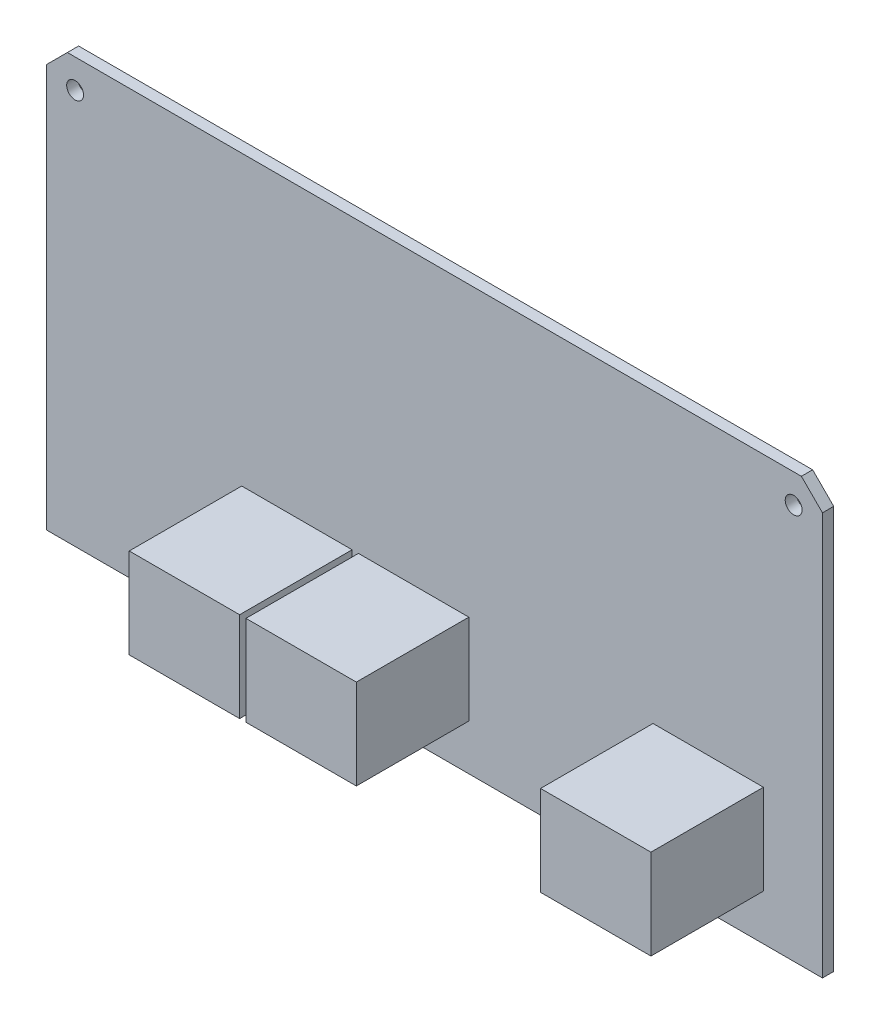
ISO-10303-21;
HEADER;
FILE_DESCRIPTION(('STEP AP214'),'2;1');
FILE_NAME('part.step','',(''),(''),'','','');
FILE_SCHEMA(('AUTOMOTIVE_DESIGN { 1 0 10303 214 1 1 1 1 }'));
ENDSEC;
DATA;
#1=APPLICATION_CONTEXT('core data for automotive mechanical design processes');
#2=APPLICATION_PROTOCOL_DEFINITION('international standard','automotive_design',2000,#1);
#3=PRODUCT_CONTEXT('',#1,'mechanical');
#4=PRODUCT('Part','Part','',(#3));
#5=PRODUCT_RELATED_PRODUCT_CATEGORY('part','',(#4));
#6=PRODUCT_DEFINITION_FORMATION('','',#4);
#7=PRODUCT_DEFINITION_CONTEXT('part definition',#1,'design');
#8=PRODUCT_DEFINITION('design','',#6,#7);
#9=PRODUCT_DEFINITION_SHAPE('','',#8);
#10=(LENGTH_UNIT() NAMED_UNIT(*) SI_UNIT(.MILLI.,.METRE.));
#11=(NAMED_UNIT(*) PLANE_ANGLE_UNIT() SI_UNIT($,.RADIAN.));
#12=(NAMED_UNIT(*) SI_UNIT($,.STERADIAN.) SOLID_ANGLE_UNIT());
#13=UNCERTAINTY_MEASURE_WITH_UNIT(LENGTH_MEASURE(1.E-05),#10,'distance_accuracy_value','');
#14=(GEOMETRIC_REPRESENTATION_CONTEXT(3) GLOBAL_UNCERTAINTY_ASSIGNED_CONTEXT((#13)) GLOBAL_UNIT_ASSIGNED_CONTEXT((#10,
#11,#12)) REPRESENTATION_CONTEXT('',''));
#15=CARTESIAN_POINT('',(0.,0.,0.));
#16=DIRECTION('',(0.,0.,1.));
#17=DIRECTION('',(1.,0.,0.));
#18=AXIS2_PLACEMENT_3D('',#15,#16,#17);
#19=CARTESIAN_POINT('',(55.2,30.15,1.6));
#20=DIRECTION('',(0.,0.,1.));
#21=DIRECTION('',(1.,0.,0.));
#22=AXIS2_PLACEMENT_3D('',#19,#20,#21);
#23=PLANE('',#22);
#24=DIRECTION('',(1.,0.,0.));
#25=VECTOR('',#24,1.);
#26=CARTESIAN_POINT('',(-10.8,-23.65,1.6));
#27=LINE('',#26,#25);
#28=CARTESIAN_POINT('',(-10.8,-23.65,1.6));
#29=VERTEX_POINT('',#28);
#30=CARTESIAN_POINT('',(4.90000000000003,-23.65,1.6));
#31=VERTEX_POINT('',#30);
#32=EDGE_CURVE('E185',#29,#31,#27,.T.);
#33=ORIENTED_EDGE('',*,*,#32,.F.);
#34=DIRECTION('',(0.,-1.,0.));
#35=VECTOR('',#34,1.);
#36=CARTESIAN_POINT('',(-10.8,-23.65,1.6));
#37=LINE('',#36,#35);
#38=CARTESIAN_POINT('',(-10.8,-10.85,1.6));
#39=VERTEX_POINT('',#38);
#40=EDGE_CURVE('E182',#39,#29,#37,.T.);
#41=ORIENTED_EDGE('',*,*,#40,.F.);
#42=DIRECTION('',(-1.,0.,0.));
#43=VECTOR('',#42,1.);
#44=CARTESIAN_POINT('',(-10.8,-10.85,1.6));
#45=LINE('',#44,#43);
#46=CARTESIAN_POINT('',(4.90000000000002,-10.85,1.6));
#47=VERTEX_POINT('',#46);
#48=EDGE_CURVE('E194',#47,#39,#45,.T.);
#49=ORIENTED_EDGE('',*,*,#48,.F.);
#50=DIRECTION('',(0.,1.,0.));
#51=VECTOR('',#50,1.);
#52=CARTESIAN_POINT('',(4.90000000000003,-23.65,1.6));
#53=LINE('',#52,#51);
#54=EDGE_CURVE('E202',#31,#47,#53,.T.);
#55=ORIENTED_EDGE('',*,*,#54,.F.);
#56=EDGE_LOOP('',(#33,#41,#49,#55));
#57=FACE_BOUND('',#56,.T.);
#58=CARTESIAN_POINT('',(51.1,26.05,1.6));
#59=DIRECTION('',(0.,0.,1.));
#60=DIRECTION('',(1.,0.,0.));
#61=AXIS2_PLACEMENT_3D('',#58,#59,#60);
#62=CIRCLE('',#61,1.2);
#63=CARTESIAN_POINT('',(52.3,26.05,1.6));
#64=VERTEX_POINT('',#63);
#65=EDGE_CURVE('E243',#64,#64,#62,.T.);
#66=ORIENTED_EDGE('',*,*,#65,.F.);
#67=EDGE_LOOP('',(#66));
#68=FACE_BOUND('',#67,.T.);
#69=DIRECTION('',(0.,1.,0.));
#70=VECTOR('',#69,1.);
#71=CARTESIAN_POINT('',(55.2,-30.15,1.6));
#72=LINE('',#71,#70);
#73=CARTESIAN_POINT('',(55.2,-30.15,1.6));
#74=VERTEX_POINT('',#73);
#75=CARTESIAN_POINT('',(55.2,27.15,1.6));
#76=VERTEX_POINT('',#75);
#77=EDGE_CURVE('E255',#74,#76,#72,.T.);
#78=ORIENTED_EDGE('',*,*,#77,.T.);
#79=DIRECTION('',(-0.707106781186548,0.707106781186547,0.));
#80=VECTOR('',#79,1.);
#81=CARTESIAN_POINT('',(55.2,27.15,1.6));
#82=LINE('',#81,#80);
#83=CARTESIAN_POINT('',(52.2,30.15,1.6));
#84=VERTEX_POINT('',#83);
#85=EDGE_CURVE('E258',#76,#84,#82,.T.);
#86=ORIENTED_EDGE('',*,*,#85,.T.);
#87=DIRECTION('',(-1.,0.,0.));
#88=VECTOR('',#87,1.);
#89=CARTESIAN_POINT('',(52.2,30.15,1.6));
#90=LINE('',#89,#88);
#91=CARTESIAN_POINT('',(-52.2,30.15,1.6));
#92=VERTEX_POINT('',#91);
#93=EDGE_CURVE('E261',#84,#92,#90,.T.);
#94=ORIENTED_EDGE('',*,*,#93,.T.);
#95=DIRECTION('',(-0.707106781186548,-0.707106781186547,0.));
#96=VECTOR('',#95,1.);
#97=CARTESIAN_POINT('',(-52.2,30.15,1.6));
#98=LINE('',#97,#96);
#99=CARTESIAN_POINT('',(-55.2,27.15,1.6));
#100=VERTEX_POINT('',#99);
#101=EDGE_CURVE('E263',#92,#100,#98,.T.);
#102=ORIENTED_EDGE('',*,*,#101,.T.);
#103=DIRECTION('',(0.,-1.,0.));
#104=VECTOR('',#103,1.);
#105=CARTESIAN_POINT('',(-55.2,-30.15,1.6));
#106=LINE('',#105,#104);
#107=CARTESIAN_POINT('',(-55.2,-30.15,1.6));
#108=VERTEX_POINT('',#107);
#109=EDGE_CURVE('E265',#100,#108,#106,.T.);
#110=ORIENTED_EDGE('',*,*,#109,.T.);
#111=DIRECTION('',(1.,0.,0.));
#112=VECTOR('',#111,1.);
#113=CARTESIAN_POINT('',(55.2,-30.15,1.6));
#114=LINE('',#113,#112);
#115=EDGE_CURVE('E267',#108,#74,#114,.T.);
#116=ORIENTED_EDGE('',*,*,#115,.T.);
#117=EDGE_LOOP('',(#78,#86,#94,#102,#110,#116));
#118=FACE_BOUND('',#117,.T.);
#119=CARTESIAN_POINT('',(-51.1,26.05,1.6));
#120=DIRECTION('',(0.,0.,1.));
#121=DIRECTION('',(1.,0.,0.));
#122=AXIS2_PLACEMENT_3D('',#119,#120,#121);
#123=CIRCLE('',#122,1.2);
#124=CARTESIAN_POINT('',(-49.9,26.05,1.6));
#125=VERTEX_POINT('',#124);
#126=EDGE_CURVE('E249',#125,#125,#123,.T.);
#127=ORIENTED_EDGE('',*,*,#126,.F.);
#128=EDGE_LOOP('',(#127));
#129=FACE_BOUND('',#128,.T.);
#130=DIRECTION('',(1.,0.,0.));
#131=VECTOR('',#130,1.);
#132=CARTESIAN_POINT('',(-27.4,-23.65,1.6));
#133=LINE('',#132,#131);
#134=CARTESIAN_POINT('',(-27.4,-23.65,1.6));
#135=VERTEX_POINT('',#134);
#136=CARTESIAN_POINT('',(-11.7,-23.65,1.6));
#137=VERTEX_POINT('',#136);
#138=EDGE_CURVE('E227',#135,#137,#133,.T.);
#139=ORIENTED_EDGE('',*,*,#138,.F.);
#140=DIRECTION('',(0.,-1.,0.));
#141=VECTOR('',#140,1.);
#142=CARTESIAN_POINT('',(-27.4,-23.65,1.6));
#143=LINE('',#142,#141);
#144=CARTESIAN_POINT('',(-27.4,-10.85,1.6));
#145=VERTEX_POINT('',#144);
#146=EDGE_CURVE('E213',#145,#135,#143,.T.);
#147=ORIENTED_EDGE('',*,*,#146,.F.);
#148=DIRECTION('',(-1.,0.,0.));
#149=VECTOR('',#148,1.);
#150=CARTESIAN_POINT('',(-27.4,-10.85,1.6));
#151=LINE('',#150,#149);
#152=CARTESIAN_POINT('',(-11.7,-10.85,1.6));
#153=VERTEX_POINT('',#152);
#154=EDGE_CURVE('E218',#153,#145,#151,.T.);
#155=ORIENTED_EDGE('',*,*,#154,.F.);
#156=DIRECTION('',(0.,1.,0.));
#157=VECTOR('',#156,1.);
#158=CARTESIAN_POINT('',(-11.7,-23.65,1.6));
#159=LINE('',#158,#157);
#160=EDGE_CURVE('E229',#137,#153,#159,.T.);
#161=ORIENTED_EDGE('',*,*,#160,.F.);
#162=EDGE_LOOP('',(#139,#147,#155,#161));
#163=FACE_BOUND('',#162,.T.);
#164=DIRECTION('',(1.,0.,0.));
#165=VECTOR('',#164,1.);
#166=CARTESIAN_POINT('',(31.1,-23.65,1.6));
#167=LINE('',#166,#165);
#168=CARTESIAN_POINT('',(31.1,-23.65,1.6));
#169=VERTEX_POINT('',#168);
#170=CARTESIAN_POINT('',(46.8,-23.65,1.6));
#171=VERTEX_POINT('',#170);
#172=EDGE_CURVE('E559',#169,#171,#167,.T.);
#173=ORIENTED_EDGE('',*,*,#172,.F.);
#174=DIRECTION('',(0.,-1.,0.));
#175=VECTOR('',#174,1.);
#176=CARTESIAN_POINT('',(31.1,-23.65,1.6));
#177=LINE('',#176,#175);
#178=CARTESIAN_POINT('',(31.1,-10.85,1.6));
#179=VERTEX_POINT('',#178);
#180=EDGE_CURVE('E180',#179,#169,#177,.T.);
#181=ORIENTED_EDGE('',*,*,#180,.F.);
#182=DIRECTION('',(-1.,0.,0.));
#183=VECTOR('',#182,1.);
#184=CARTESIAN_POINT('',(31.1,-10.85,1.6));
#185=LINE('',#184,#183);
#186=CARTESIAN_POINT('',(46.8,-10.85,1.6));
#187=VERTEX_POINT('',#186);
#188=EDGE_CURVE('E176',#187,#179,#185,.T.);
#189=ORIENTED_EDGE('',*,*,#188,.F.);
#190=DIRECTION('',(0.,1.,0.));
#191=VECTOR('',#190,1.);
#192=CARTESIAN_POINT('',(46.8,-23.65,1.6));
#193=LINE('',#192,#191);
#194=EDGE_CURVE('E556',#171,#187,#193,.T.);
#195=ORIENTED_EDGE('',*,*,#194,.F.);
#196=EDGE_LOOP('',(#173,#181,#189,#195));
#197=FACE_BOUND('',#196,.T.);
#198=ADVANCED_FACE('F31',(#57,#68,#118,#129,#163,#197),#23,.T.);
#199=CARTESIAN_POINT('',(55.2,30.15,0.));
#200=DIRECTION('',(0.,0.,1.));
#201=DIRECTION('',(1.,0.,0.));
#202=AXIS2_PLACEMENT_3D('',#199,#200,#201);
#203=PLANE('',#202);
#204=CARTESIAN_POINT('',(-51.1,26.05,0.));
#205=DIRECTION('',(0.,0.,1.));
#206=DIRECTION('',(1.,0.,0.));
#207=AXIS2_PLACEMENT_3D('',#204,#205,#206);
#208=CIRCLE('',#207,1.2);
#209=CARTESIAN_POINT('',(-49.9,26.05,0.));
#210=VERTEX_POINT('',#209);
#211=EDGE_CURVE('E246',#210,#210,#208,.T.);
#212=ORIENTED_EDGE('',*,*,#211,.T.);
#213=EDGE_LOOP('',(#212));
#214=FACE_BOUND('',#213,.T.);
#215=DIRECTION('',(0.,1.,0.));
#216=VECTOR('',#215,1.);
#217=CARTESIAN_POINT('',(55.2,-30.15,0.));
#218=LINE('',#217,#216);
#219=CARTESIAN_POINT('',(55.2,-30.15,0.));
#220=VERTEX_POINT('',#219);
#221=CARTESIAN_POINT('',(55.2,27.15,0.));
#222=VERTEX_POINT('',#221);
#223=EDGE_CURVE('E252',#220,#222,#218,.T.);
#224=ORIENTED_EDGE('',*,*,#223,.F.);
#225=DIRECTION('',(1.,0.,0.));
#226=VECTOR('',#225,1.);
#227=CARTESIAN_POINT('',(55.2,-30.15,0.));
#228=LINE('',#227,#226);
#229=CARTESIAN_POINT('',(-55.2,-30.15,0.));
#230=VERTEX_POINT('',#229);
#231=EDGE_CURVE('E259',#230,#220,#228,.T.);
#232=ORIENTED_EDGE('',*,*,#231,.F.);
#233=DIRECTION('',(0.,-1.,0.));
#234=VECTOR('',#233,1.);
#235=CARTESIAN_POINT('',(-55.2,-30.15,0.));
#236=LINE('',#235,#234);
#237=CARTESIAN_POINT('',(-55.2,27.15,0.));
#238=VERTEX_POINT('',#237);
#239=EDGE_CURVE('E278',#238,#230,#236,.T.);
#240=ORIENTED_EDGE('',*,*,#239,.F.);
#241=DIRECTION('',(-0.707106781186548,-0.707106781186547,0.));
#242=VECTOR('',#241,1.);
#243=CARTESIAN_POINT('',(-52.2,30.15,0.));
#244=LINE('',#243,#242);
#245=CARTESIAN_POINT('',(-52.2,30.15,0.));
#246=VERTEX_POINT('',#245);
#247=EDGE_CURVE('E276',#246,#238,#244,.T.);
#248=ORIENTED_EDGE('',*,*,#247,.F.);
#249=DIRECTION('',(-1.,0.,0.));
#250=VECTOR('',#249,1.);
#251=CARTESIAN_POINT('',(52.2,30.15,0.));
#252=LINE('',#251,#250);
#253=CARTESIAN_POINT('',(52.2,30.15,0.));
#254=VERTEX_POINT('',#253);
#255=EDGE_CURVE('E274',#254,#246,#252,.T.);
#256=ORIENTED_EDGE('',*,*,#255,.F.);
#257=DIRECTION('',(-0.707106781186548,0.707106781186547,0.));
#258=VECTOR('',#257,1.);
#259=CARTESIAN_POINT('',(55.2,27.15,0.));
#260=LINE('',#259,#258);
#261=EDGE_CURVE('E272',#222,#254,#260,.T.);
#262=ORIENTED_EDGE('',*,*,#261,.F.);
#263=EDGE_LOOP('',(#224,#232,#240,#248,#256,#262));
#264=FACE_BOUND('',#263,.T.);
#265=CARTESIAN_POINT('',(51.1,26.05,0.));
#266=DIRECTION('',(0.,0.,1.));
#267=DIRECTION('',(1.,0.,0.));
#268=AXIS2_PLACEMENT_3D('',#265,#266,#267);
#269=CIRCLE('',#268,1.2);
#270=CARTESIAN_POINT('',(52.3,26.05,0.));
#271=VERTEX_POINT('',#270);
#272=EDGE_CURVE('E242',#271,#271,#269,.T.);
#273=ORIENTED_EDGE('',*,*,#272,.T.);
#274=EDGE_LOOP('',(#273));
#275=FACE_BOUND('',#274,.T.);
#276=ADVANCED_FACE('F302',(#214,#264,#275),#203,.F.);
#277=CARTESIAN_POINT('',(55.2,-30.15,1.6));
#278=DIRECTION('',(-1.,0.,0.));
#279=DIRECTION('',(0.,0.,1.));
#280=AXIS2_PLACEMENT_3D('',#277,#278,#279);
#281=PLANE('',#280);
#282=ORIENTED_EDGE('',*,*,#223,.T.);
#283=DIRECTION('',(0.,0.,-1.));
#284=VECTOR('',#283,1.);
#285=CARTESIAN_POINT('',(55.2,27.15,1.6));
#286=LINE('',#285,#284);
#287=EDGE_CURVE('E11',#76,#222,#286,.T.);
#288=ORIENTED_EDGE('',*,*,#287,.F.);
#289=ORIENTED_EDGE('',*,*,#77,.F.);
#290=DIRECTION('',(0.,0.,-1.));
#291=VECTOR('',#290,1.);
#292=CARTESIAN_POINT('',(55.2,-30.15,1.6));
#293=LINE('',#292,#291);
#294=EDGE_CURVE('E269',#74,#220,#293,.T.);
#295=ORIENTED_EDGE('',*,*,#294,.T.);
#296=EDGE_LOOP('',(#282,#288,#289,#295));
#297=FACE_BOUND('',#296,.T.);
#298=ADVANCED_FACE('F33',(#297),#281,.F.);
#299=CARTESIAN_POINT('',(55.2,27.15,1.6));
#300=DIRECTION('',(-0.707106781186547,-0.707106781186548,0.));
#301=DIRECTION('',(0.707106781186548,-0.707106781186547,0.));
#302=AXIS2_PLACEMENT_3D('',#299,#300,#301);
#303=PLANE('',#302);
#304=ORIENTED_EDGE('',*,*,#261,.T.);
#305=DIRECTION('',(0.,0.,-1.));
#306=VECTOR('',#305,1.);
#307=CARTESIAN_POINT('',(52.2,30.15,1.6));
#308=LINE('',#307,#306);
#309=EDGE_CURVE('E39',#84,#254,#308,.T.);
#310=ORIENTED_EDGE('',*,*,#309,.F.);
#311=ORIENTED_EDGE('',*,*,#85,.F.);
#312=ORIENTED_EDGE('',*,*,#287,.T.);
#313=EDGE_LOOP('',(#304,#310,#311,#312));
#314=FACE_BOUND('',#313,.T.);
#315=ADVANCED_FACE('F320',(#314),#303,.F.);
#316=CARTESIAN_POINT('',(52.2,30.15,1.6));
#317=DIRECTION('',(0.,-1.,0.));
#318=DIRECTION('',(1.,0.,0.));
#319=AXIS2_PLACEMENT_3D('',#316,#317,#318);
#320=PLANE('',#319);
#321=ORIENTED_EDGE('',*,*,#255,.T.);
#322=DIRECTION('',(0.,0.,-1.));
#323=VECTOR('',#322,1.);
#324=CARTESIAN_POINT('',(-52.2,30.15,1.6));
#325=LINE('',#324,#323);
#326=EDGE_CURVE('E289',#92,#246,#325,.T.);
#327=ORIENTED_EDGE('',*,*,#326,.F.);
#328=ORIENTED_EDGE('',*,*,#93,.F.);
#329=ORIENTED_EDGE('',*,*,#309,.T.);
#330=EDGE_LOOP('',(#321,#327,#328,#329));
#331=FACE_BOUND('',#330,.T.);
#332=ADVANCED_FACE('F296',(#331),#320,.F.);
#333=CARTESIAN_POINT('',(-52.2,30.15,1.6));
#334=DIRECTION('',(0.707106781186547,-0.707106781186548,0.));
#335=DIRECTION('',(0.707106781186548,0.707106781186547,0.));
#336=AXIS2_PLACEMENT_3D('',#333,#334,#335);
#337=PLANE('',#336);
#338=ORIENTED_EDGE('',*,*,#247,.T.);
#339=DIRECTION('',(0.,0.,-1.));
#340=VECTOR('',#339,1.);
#341=CARTESIAN_POINT('',(-55.2,27.15,1.6));
#342=LINE('',#341,#340);
#343=EDGE_CURVE('E286',#100,#238,#342,.T.);
#344=ORIENTED_EDGE('',*,*,#343,.F.);
#345=ORIENTED_EDGE('',*,*,#101,.F.);
#346=ORIENTED_EDGE('',*,*,#326,.T.);
#347=EDGE_LOOP('',(#338,#344,#345,#346));
#348=FACE_BOUND('',#347,.T.);
#349=ADVANCED_FACE('F308',(#348),#337,.F.);
#350=CARTESIAN_POINT('',(-55.2,-30.15,1.6));
#351=DIRECTION('',(1.,0.,0.));
#352=DIRECTION('',(0.,0.,-1.));
#353=AXIS2_PLACEMENT_3D('',#350,#351,#352);
#354=PLANE('',#353);
#355=ORIENTED_EDGE('',*,*,#239,.T.);
#356=DIRECTION('',(0.,0.,-1.));
#357=VECTOR('',#356,1.);
#358=CARTESIAN_POINT('',(-55.2,-30.15,1.6));
#359=LINE('',#358,#357);
#360=EDGE_CURVE('E283',#108,#230,#359,.T.);
#361=ORIENTED_EDGE('',*,*,#360,.F.);
#362=ORIENTED_EDGE('',*,*,#109,.F.);
#363=ORIENTED_EDGE('',*,*,#343,.T.);
#364=EDGE_LOOP('',(#355,#361,#362,#363));
#365=FACE_BOUND('',#364,.T.);
#366=ADVANCED_FACE('F312',(#365),#354,.F.);
#367=CARTESIAN_POINT('',(55.2,-30.15,1.6));
#368=DIRECTION('',(0.,1.,0.));
#369=DIRECTION('',(-1.,0.,0.));
#370=AXIS2_PLACEMENT_3D('',#367,#368,#369);
#371=PLANE('',#370);
#372=ORIENTED_EDGE('',*,*,#231,.T.);
#373=ORIENTED_EDGE('',*,*,#294,.F.);
#374=ORIENTED_EDGE('',*,*,#115,.F.);
#375=ORIENTED_EDGE('',*,*,#360,.T.);
#376=EDGE_LOOP('',(#372,#373,#374,#375));
#377=FACE_BOUND('',#376,.T.);
#378=ADVANCED_FACE('F323',(#377),#371,.F.);
#379=CARTESIAN_POINT('',(-51.1,26.05,1.6));
#380=DIRECTION('',(0.,0.,-1.));
#381=DIRECTION('',(-1.,0.,0.));
#382=AXIS2_PLACEMENT_3D('',#379,#380,#381);
#383=CYLINDRICAL_SURFACE('',#382,1.2);
#384=ORIENTED_EDGE('',*,*,#126,.T.);
#385=EDGE_LOOP('',(#384));
#386=FACE_BOUND('',#385,.T.);
#387=ORIENTED_EDGE('',*,*,#211,.F.);
#388=EDGE_LOOP('',(#387));
#389=FACE_BOUND('',#388,.T.);
#390=ADVANCED_FACE('F325',(#386,#389),#383,.F.);
#391=CARTESIAN_POINT('',(51.1,26.05,1.6));
#392=DIRECTION('',(0.,0.,-1.));
#393=DIRECTION('',(-1.,0.,0.));
#394=AXIS2_PLACEMENT_3D('',#391,#392,#393);
#395=CYLINDRICAL_SURFACE('',#394,1.2);
#396=ORIENTED_EDGE('',*,*,#65,.T.);
#397=EDGE_LOOP('',(#396));
#398=FACE_BOUND('',#397,.T.);
#399=ORIENTED_EDGE('',*,*,#272,.F.);
#400=EDGE_LOOP('',(#399));
#401=FACE_BOUND('',#400,.T.);
#402=ADVANCED_FACE('F331',(#398,#401),#395,.F.);
#403=CARTESIAN_POINT('',(-27.4,-23.65,17.6));
#404=DIRECTION('',(1.,0.,0.));
#405=DIRECTION('',(0.,0.,-1.));
#406=AXIS2_PLACEMENT_3D('',#403,#404,#405);
#407=PLANE('',#406);
#408=ORIENTED_EDGE('',*,*,#146,.T.);
#409=DIRECTION('',(0.,0.,-1.));
#410=VECTOR('',#409,1.);
#411=CARTESIAN_POINT('',(-27.4,-23.65,17.6));
#412=LINE('',#411,#410);
#413=CARTESIAN_POINT('',(-27.4,-23.65,17.6));
#414=VERTEX_POINT('',#413);
#415=EDGE_CURVE('E240',#414,#135,#412,.T.);
#416=ORIENTED_EDGE('',*,*,#415,.F.);
#417=DIRECTION('',(0.,-1.,0.));
#418=VECTOR('',#417,1.);
#419=CARTESIAN_POINT('',(-27.4,-23.65,17.6));
#420=LINE('',#419,#418);
#421=CARTESIAN_POINT('',(-27.4,-10.85,17.6));
#422=VERTEX_POINT('',#421);
#423=EDGE_CURVE('E214',#422,#414,#420,.T.);
#424=ORIENTED_EDGE('',*,*,#423,.F.);
#425=DIRECTION('',(0.,0.,-1.));
#426=VECTOR('',#425,1.);
#427=CARTESIAN_POINT('',(-27.4,-10.85,17.6));
#428=LINE('',#427,#426);
#429=EDGE_CURVE('E224',#422,#145,#428,.T.);
#430=ORIENTED_EDGE('',*,*,#429,.T.);
#431=EDGE_LOOP('',(#408,#416,#424,#430));
#432=FACE_BOUND('',#431,.T.);
#433=ADVANCED_FACE('F348',(#432),#407,.F.);
#434=CARTESIAN_POINT('',(-27.4,-23.65,17.6));
#435=DIRECTION('',(0.,1.,0.));
#436=DIRECTION('',(0.,0.,1.));
#437=AXIS2_PLACEMENT_3D('',#434,#435,#436);
#438=PLANE('',#437);
#439=ORIENTED_EDGE('',*,*,#138,.T.);
#440=DIRECTION('',(0.,0.,-1.));
#441=VECTOR('',#440,1.);
#442=CARTESIAN_POINT('',(-11.7,-23.65,17.6));
#443=LINE('',#442,#441);
#444=CARTESIAN_POINT('',(-11.7,-23.65,17.6));
#445=VERTEX_POINT('',#444);
#446=EDGE_CURVE('E237',#445,#137,#443,.T.);
#447=ORIENTED_EDGE('',*,*,#446,.F.);
#448=DIRECTION('',(1.,0.,0.));
#449=VECTOR('',#448,1.);
#450=CARTESIAN_POINT('',(-27.4,-23.65,17.6));
#451=LINE('',#450,#449);
#452=EDGE_CURVE('E217',#414,#445,#451,.T.);
#453=ORIENTED_EDGE('',*,*,#452,.F.);
#454=ORIENTED_EDGE('',*,*,#415,.T.);
#455=EDGE_LOOP('',(#439,#447,#453,#454));
#456=FACE_BOUND('',#455,.T.);
#457=ADVANCED_FACE('F352',(#456),#438,.F.);
#458=CARTESIAN_POINT('',(-11.7,-23.65,17.6));
#459=DIRECTION('',(-1.,0.,0.));
#460=DIRECTION('',(0.,0.,1.));
#461=AXIS2_PLACEMENT_3D('',#458,#459,#460);
#462=PLANE('',#461);
#463=ORIENTED_EDGE('',*,*,#160,.T.);
#464=DIRECTION('',(0.,0.,-1.));
#465=VECTOR('',#464,1.);
#466=CARTESIAN_POINT('',(-11.7,-10.85,17.6));
#467=LINE('',#466,#465);
#468=CARTESIAN_POINT('',(-11.7,-10.85,17.6));
#469=VERTEX_POINT('',#468);
#470=EDGE_CURVE('E235',#469,#153,#467,.T.);
#471=ORIENTED_EDGE('',*,*,#470,.F.);
#472=DIRECTION('',(0.,1.,0.));
#473=VECTOR('',#472,1.);
#474=CARTESIAN_POINT('',(-11.7,-23.65,17.6));
#475=LINE('',#474,#473);
#476=EDGE_CURVE('E220',#445,#469,#475,.T.);
#477=ORIENTED_EDGE('',*,*,#476,.F.);
#478=ORIENTED_EDGE('',*,*,#446,.T.);
#479=EDGE_LOOP('',(#463,#471,#477,#478));
#480=FACE_BOUND('',#479,.T.);
#481=ADVANCED_FACE('F356',(#480),#462,.F.);
#482=CARTESIAN_POINT('',(-27.4,-10.85,17.6));
#483=DIRECTION('',(0.,-1.,0.));
#484=DIRECTION('',(0.,0.,-1.));
#485=AXIS2_PLACEMENT_3D('',#482,#483,#484);
#486=PLANE('',#485);
#487=ORIENTED_EDGE('',*,*,#154,.T.);
#488=ORIENTED_EDGE('',*,*,#429,.F.);
#489=DIRECTION('',(-1.,0.,0.));
#490=VECTOR('',#489,1.);
#491=CARTESIAN_POINT('',(-27.4,-10.85,17.6));
#492=LINE('',#491,#490);
#493=EDGE_CURVE('E222',#469,#422,#492,.T.);
#494=ORIENTED_EDGE('',*,*,#493,.F.);
#495=ORIENTED_EDGE('',*,*,#470,.T.);
#496=EDGE_LOOP('',(#487,#488,#494,#495));
#497=FACE_BOUND('',#496,.T.);
#498=ADVANCED_FACE('F360',(#497),#486,.F.);
#499=CARTESIAN_POINT('',(-27.4,-10.85,17.6));
#500=DIRECTION('',(0.,0.,-1.));
#501=DIRECTION('',(-1.,0.,0.));
#502=AXIS2_PLACEMENT_3D('',#499,#500,#501);
#503=PLANE('',#502);
#504=ORIENTED_EDGE('',*,*,#423,.T.);
#505=ORIENTED_EDGE('',*,*,#452,.T.);
#506=ORIENTED_EDGE('',*,*,#476,.T.);
#507=ORIENTED_EDGE('',*,*,#493,.T.);
#508=EDGE_LOOP('',(#504,#505,#506,#507));
#509=FACE_BOUND('',#508,.T.);
#510=ADVANCED_FACE('F364',(#509),#503,.F.);
#511=CARTESIAN_POINT('',(-10.8,-23.65,17.6));
#512=DIRECTION('',(1.,0.,0.));
#513=DIRECTION('',(0.,0.,-1.));
#514=AXIS2_PLACEMENT_3D('',#511,#512,#513);
#515=PLANE('',#514);
#516=ORIENTED_EDGE('',*,*,#40,.T.);
#517=DIRECTION('',(0.,0.,-1.));
#518=VECTOR('',#517,1.);
#519=CARTESIAN_POINT('',(-10.8,-23.65,17.6));
#520=LINE('',#519,#518);
#521=CARTESIAN_POINT('',(-10.8,-23.65,17.6));
#522=VERTEX_POINT('',#521);
#523=EDGE_CURVE('E211',#522,#29,#520,.T.);
#524=ORIENTED_EDGE('',*,*,#523,.F.);
#525=DIRECTION('',(0.,-1.,0.));
#526=VECTOR('',#525,1.);
#527=CARTESIAN_POINT('',(-10.8,-23.65,17.6));
#528=LINE('',#527,#526);
#529=CARTESIAN_POINT('',(-10.8,-10.85,17.6));
#530=VERTEX_POINT('',#529);
#531=EDGE_CURVE('E190',#530,#522,#528,.T.);
#532=ORIENTED_EDGE('',*,*,#531,.F.);
#533=DIRECTION('',(0.,0.,-1.));
#534=VECTOR('',#533,1.);
#535=CARTESIAN_POINT('',(-10.8,-10.85,17.6));
#536=LINE('',#535,#534);
#537=EDGE_CURVE('E199',#530,#39,#536,.T.);
#538=ORIENTED_EDGE('',*,*,#537,.T.);
#539=EDGE_LOOP('',(#516,#524,#532,#538));
#540=FACE_BOUND('',#539,.T.);
#541=ADVANCED_FACE('F368',(#540),#515,.F.);
#542=CARTESIAN_POINT('',(-10.8,-23.65,17.6));
#543=DIRECTION('',(0.,1.,0.));
#544=DIRECTION('',(0.,0.,1.));
#545=AXIS2_PLACEMENT_3D('',#542,#543,#544);
#546=PLANE('',#545);
#547=ORIENTED_EDGE('',*,*,#32,.T.);
#548=DIRECTION('',(0.,0.,-1.));
#549=VECTOR('',#548,1.);
#550=CARTESIAN_POINT('',(4.90000000000003,-23.65,17.6));
#551=LINE('',#550,#549);
#552=CARTESIAN_POINT('',(4.90000000000003,-23.65,17.6));
#553=VERTEX_POINT('',#552);
#554=EDGE_CURVE('E208',#553,#31,#551,.T.);
#555=ORIENTED_EDGE('',*,*,#554,.F.);
#556=DIRECTION('',(1.,0.,0.));
#557=VECTOR('',#556,1.);
#558=CARTESIAN_POINT('',(-10.8,-23.65,17.6));
#559=LINE('',#558,#557);
#560=EDGE_CURVE('E193',#522,#553,#559,.T.);
#561=ORIENTED_EDGE('',*,*,#560,.F.);
#562=ORIENTED_EDGE('',*,*,#523,.T.);
#563=EDGE_LOOP('',(#547,#555,#561,#562));
#564=FACE_BOUND('',#563,.T.);
#565=ADVANCED_FACE('F372',(#564),#546,.F.);
#566=CARTESIAN_POINT('',(4.90000000000003,-23.65,17.6));
#567=DIRECTION('',(-1.,0.,0.));
#568=DIRECTION('',(0.,0.,1.));
#569=AXIS2_PLACEMENT_3D('',#566,#567,#568);
#570=PLANE('',#569);
#571=ORIENTED_EDGE('',*,*,#54,.T.);
#572=DIRECTION('',(0.,0.,-1.));
#573=VECTOR('',#572,1.);
#574=CARTESIAN_POINT('',(4.90000000000003,-10.85,17.6));
#575=LINE('',#574,#573);
#576=CARTESIAN_POINT('',(4.90000000000003,-10.85,17.6));
#577=VERTEX_POINT('',#576);
#578=EDGE_CURVE('E54',#577,#47,#575,.T.);
#579=ORIENTED_EDGE('',*,*,#578,.F.);
#580=DIRECTION('',(0.,1.,0.));
#581=VECTOR('',#580,1.);
#582=CARTESIAN_POINT('',(4.90000000000003,-23.65,17.6));
#583=LINE('',#582,#581);
#584=EDGE_CURVE('E196',#553,#577,#583,.T.);
#585=ORIENTED_EDGE('',*,*,#584,.F.);
#586=ORIENTED_EDGE('',*,*,#554,.T.);
#587=EDGE_LOOP('',(#571,#579,#585,#586));
#588=FACE_BOUND('',#587,.T.);
#589=ADVANCED_FACE('F376',(#588),#570,.F.);
#590=CARTESIAN_POINT('',(-10.8,-10.85,17.6));
#591=DIRECTION('',(0.,-1.,0.));
#592=DIRECTION('',(0.,0.,-1.));
#593=AXIS2_PLACEMENT_3D('',#590,#591,#592);
#594=PLANE('',#593);
#595=ORIENTED_EDGE('',*,*,#48,.T.);
#596=ORIENTED_EDGE('',*,*,#537,.F.);
#597=DIRECTION('',(-1.,0.,0.));
#598=VECTOR('',#597,1.);
#599=CARTESIAN_POINT('',(-10.8,-10.85,17.6));
#600=LINE('',#599,#598);
#601=EDGE_CURVE('E198',#577,#530,#600,.T.);
#602=ORIENTED_EDGE('',*,*,#601,.F.);
#603=ORIENTED_EDGE('',*,*,#578,.T.);
#604=EDGE_LOOP('',(#595,#596,#602,#603));
#605=FACE_BOUND('',#604,.T.);
#606=ADVANCED_FACE('F380',(#605),#594,.F.);
#607=CARTESIAN_POINT('',(-10.8,-10.85,17.6));
#608=DIRECTION('',(0.,0.,-1.));
#609=DIRECTION('',(-1.,0.,0.));
#610=AXIS2_PLACEMENT_3D('',#607,#608,#609);
#611=PLANE('',#610);
#612=ORIENTED_EDGE('',*,*,#531,.T.);
#613=ORIENTED_EDGE('',*,*,#560,.T.);
#614=ORIENTED_EDGE('',*,*,#584,.T.);
#615=ORIENTED_EDGE('',*,*,#601,.T.);
#616=EDGE_LOOP('',(#612,#613,#614,#615));
#617=FACE_BOUND('',#616,.T.);
#618=ADVANCED_FACE('F384',(#617),#611,.F.);
#619=CARTESIAN_POINT('',(31.1,-23.65,17.6));
#620=DIRECTION('',(1.,0.,0.));
#621=DIRECTION('',(0.,0.,-1.));
#622=AXIS2_PLACEMENT_3D('',#619,#620,#621);
#623=PLANE('',#622);
#624=ORIENTED_EDGE('',*,*,#180,.T.);
#625=DIRECTION('',(0.,0.,-1.));
#626=VECTOR('',#625,1.);
#627=CARTESIAN_POINT('',(31.1,-23.65,17.6));
#628=LINE('',#627,#626);
#629=CARTESIAN_POINT('',(31.1,-23.65,17.6));
#630=VERTEX_POINT('',#629);
#631=EDGE_CURVE('E161',#630,#169,#628,.T.);
#632=ORIENTED_EDGE('',*,*,#631,.F.);
#633=DIRECTION('',(0.,-1.,0.));
#634=VECTOR('',#633,1.);
#635=CARTESIAN_POINT('',(31.1,-23.65,17.6));
#636=LINE('',#635,#634);
#637=CARTESIAN_POINT('',(31.1,-10.85,17.6));
#638=VERTEX_POINT('',#637);
#639=EDGE_CURVE('E168',#638,#630,#636,.T.);
#640=ORIENTED_EDGE('',*,*,#639,.F.);
#641=DIRECTION('',(0.,0.,-1.));
#642=VECTOR('',#641,1.);
#643=CARTESIAN_POINT('',(31.1,-10.85,17.6));
#644=LINE('',#643,#642);
#645=EDGE_CURVE('E553',#638,#179,#644,.T.);
#646=ORIENTED_EDGE('',*,*,#645,.T.);
#647=EDGE_LOOP('',(#624,#632,#640,#646));
#648=FACE_BOUND('',#647,.T.);
#649=ADVANCED_FACE('F178',(#648),#623,.F.);
#650=CARTESIAN_POINT('',(31.1,-23.65,17.6));
#651=DIRECTION('',(0.,1.,0.));
#652=DIRECTION('',(0.,0.,1.));
#653=AXIS2_PLACEMENT_3D('',#650,#651,#652);
#654=PLANE('',#653);
#655=ORIENTED_EDGE('',*,*,#172,.T.);
#656=DIRECTION('',(0.,0.,-1.));
#657=VECTOR('',#656,1.);
#658=CARTESIAN_POINT('',(46.8,-23.65,17.6));
#659=LINE('',#658,#657);
#660=CARTESIAN_POINT('',(46.8,-23.65,17.6));
#661=VERTEX_POINT('',#660);
#662=EDGE_CURVE('E164',#661,#171,#659,.T.);
#663=ORIENTED_EDGE('',*,*,#662,.F.);
#664=DIRECTION('',(1.,0.,0.));
#665=VECTOR('',#664,1.);
#666=CARTESIAN_POINT('',(31.1,-23.65,17.6));
#667=LINE('',#666,#665);
#668=EDGE_CURVE('E157',#630,#661,#667,.T.);
#669=ORIENTED_EDGE('',*,*,#668,.F.);
#670=ORIENTED_EDGE('',*,*,#631,.T.);
#671=EDGE_LOOP('',(#655,#663,#669,#670));
#672=FACE_BOUND('',#671,.T.);
#673=ADVANCED_FACE('F159',(#672),#654,.F.);
#674=CARTESIAN_POINT('',(46.8,-23.65,17.6));
#675=DIRECTION('',(-1.,0.,0.));
#676=DIRECTION('',(0.,0.,1.));
#677=AXIS2_PLACEMENT_3D('',#674,#675,#676);
#678=PLANE('',#677);
#679=ORIENTED_EDGE('',*,*,#194,.T.);
#680=DIRECTION('',(0.,0.,-1.));
#681=VECTOR('',#680,1.);
#682=CARTESIAN_POINT('',(46.8,-10.85,17.6));
#683=LINE('',#682,#681);
#684=CARTESIAN_POINT('',(46.8,-10.85,17.6));
#685=VERTEX_POINT('',#684);
#686=EDGE_CURVE('E46',#685,#187,#683,.T.);
#687=ORIENTED_EDGE('',*,*,#686,.F.);
#688=DIRECTION('',(0.,1.,0.));
#689=VECTOR('',#688,1.);
#690=CARTESIAN_POINT('',(46.8,-23.65,17.6));
#691=LINE('',#690,#689);
#692=EDGE_CURVE('E167',#661,#685,#691,.T.);
#693=ORIENTED_EDGE('',*,*,#692,.F.);
#694=ORIENTED_EDGE('',*,*,#662,.T.);
#695=EDGE_LOOP('',(#679,#687,#693,#694));
#696=FACE_BOUND('',#695,.T.);
#697=ADVANCED_FACE('F392',(#696),#678,.F.);
#698=CARTESIAN_POINT('',(31.1,-10.85,17.6));
#699=DIRECTION('',(0.,-1.,0.));
#700=DIRECTION('',(0.,0.,-1.));
#701=AXIS2_PLACEMENT_3D('',#698,#699,#700);
#702=PLANE('',#701);
#703=ORIENTED_EDGE('',*,*,#188,.T.);
#704=ORIENTED_EDGE('',*,*,#645,.F.);
#705=DIRECTION('',(-1.,0.,0.));
#706=VECTOR('',#705,1.);
#707=CARTESIAN_POINT('',(31.1,-10.85,17.6));
#708=LINE('',#707,#706);
#709=EDGE_CURVE('E172',#685,#638,#708,.T.);
#710=ORIENTED_EDGE('',*,*,#709,.F.);
#711=ORIENTED_EDGE('',*,*,#686,.T.);
#712=EDGE_LOOP('',(#703,#704,#710,#711));
#713=FACE_BOUND('',#712,.T.);
#714=ADVANCED_FACE('F395',(#713),#702,.F.);
#715=CARTESIAN_POINT('',(31.1,-10.85,17.6));
#716=DIRECTION('',(0.,0.,-1.));
#717=DIRECTION('',(-1.,0.,0.));
#718=AXIS2_PLACEMENT_3D('',#715,#716,#717);
#719=PLANE('',#718);
#720=ORIENTED_EDGE('',*,*,#639,.T.);
#721=ORIENTED_EDGE('',*,*,#668,.T.);
#722=ORIENTED_EDGE('',*,*,#692,.T.);
#723=ORIENTED_EDGE('',*,*,#709,.T.);
#724=EDGE_LOOP('',(#720,#721,#722,#723));
#725=FACE_BOUND('',#724,.T.);
#726=ADVANCED_FACE('F171',(#725),#719,.F.);
#727=CLOSED_SHELL('',(#198,#276,#298,#315,#332,#349,#366,#378,#390,#402,#433,#457,#481,#498,
#510,#541,#565,#589,#606,#618,#649,#673,#697,#714,#726));
#728=MANIFOLD_SOLID_BREP('B2',#727);
#729=ADVANCED_BREP_SHAPE_REPRESENTATION('',(#18,#728),#14);
#730=SHAPE_DEFINITION_REPRESENTATION(#9,#729);
ENDSEC;
END-ISO-10303-21;
